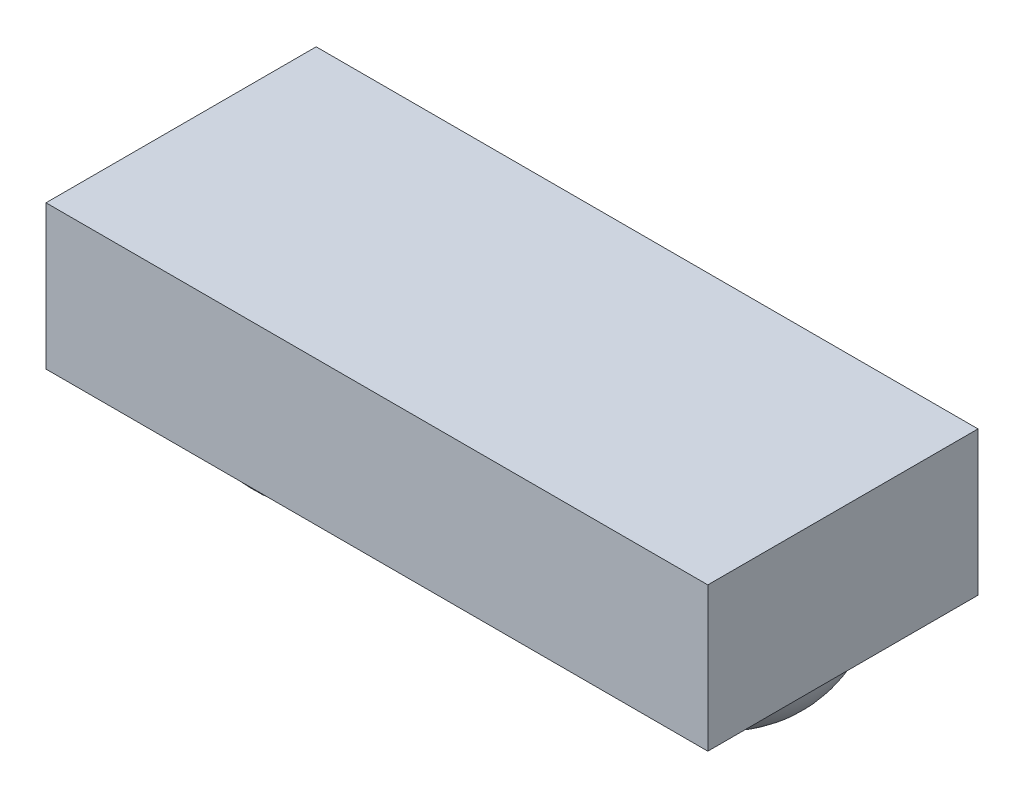
ISO-10303-21;
HEADER;
FILE_DESCRIPTION(('STEP AP214'),'2;1');
FILE_NAME('part.step','',(''),(''),'','','');
FILE_SCHEMA(('AUTOMOTIVE_DESIGN { 1 0 10303 214 1 1 1 1 }'));
ENDSEC;
DATA;
#1=APPLICATION_CONTEXT('core data for automotive mechanical design processes');
#2=APPLICATION_PROTOCOL_DEFINITION('international standard','automotive_design',2000,#1);
#3=PRODUCT_CONTEXT('',#1,'mechanical');
#4=PRODUCT('Part','Part','',(#3));
#5=PRODUCT_RELATED_PRODUCT_CATEGORY('part','',(#4));
#6=PRODUCT_DEFINITION_FORMATION('','',#4);
#7=PRODUCT_DEFINITION_CONTEXT('part definition',#1,'design');
#8=PRODUCT_DEFINITION('design','',#6,#7);
#9=PRODUCT_DEFINITION_SHAPE('','',#8);
#10=(LENGTH_UNIT() NAMED_UNIT(*) SI_UNIT(.MILLI.,.METRE.));
#11=(NAMED_UNIT(*) PLANE_ANGLE_UNIT() SI_UNIT($,.RADIAN.));
#12=(NAMED_UNIT(*) SI_UNIT($,.STERADIAN.) SOLID_ANGLE_UNIT());
#13=UNCERTAINTY_MEASURE_WITH_UNIT(LENGTH_MEASURE(1.E-05),#10,'distance_accuracy_value','');
#14=(GEOMETRIC_REPRESENTATION_CONTEXT(3) GLOBAL_UNCERTAINTY_ASSIGNED_CONTEXT((#13)) GLOBAL_UNIT_ASSIGNED_CONTEXT((#10,
#11,#12)) REPRESENTATION_CONTEXT('',''));
#15=CARTESIAN_POINT('',(0.,0.,0.));
#16=DIRECTION('',(0.,0.,1.));
#17=DIRECTION('',(1.,0.,0.));
#18=AXIS2_PLACEMENT_3D('',#15,#16,#17);
#19=CARTESIAN_POINT('',(0.,3.59044061302682,4.07));
#20=DIRECTION('',(0.,-1.,0.));
#21=DIRECTION('',(0.,0.,-1.));
#22=AXIS2_PLACEMENT_3D('',#19,#20,#21);
#23=PLANE('',#22);
#24=DIRECTION('',(-1.,0.,0.));
#25=VECTOR('',#24,1.);
#26=CARTESIAN_POINT('',(0.,3.59044061302682,0.));
#27=LINE('',#26,#25);
#28=CARTESIAN_POINT('',(4.985,3.59044061302682,0.));
#29=VERTEX_POINT('',#28);
#30=CARTESIAN_POINT('',(-4.985,3.59044061302682,0.));
#31=VERTEX_POINT('',#30);
#32=EDGE_CURVE('E129',#29,#31,#27,.T.);
#33=ORIENTED_EDGE('',*,*,#32,.T.);
#34=DIRECTION('',(0.,0.,-1.));
#35=VECTOR('',#34,1.);
#36=CARTESIAN_POINT('',(-4.985,3.59044061302682,4.07));
#37=LINE('',#36,#35);
#38=CARTESIAN_POINT('',(-4.985,3.59044061302682,4.07));
#39=VERTEX_POINT('',#38);
#40=EDGE_CURVE('E160',#39,#31,#37,.T.);
#41=ORIENTED_EDGE('',*,*,#40,.F.);
#42=DIRECTION('',(-1.,0.,0.));
#43=VECTOR('',#42,1.);
#44=CARTESIAN_POINT('',(0.,3.59044061302682,4.07));
#45=LINE('',#44,#43);
#46=CARTESIAN_POINT('',(4.985,3.59044061302682,4.07));
#47=VERTEX_POINT('',#46);
#48=EDGE_CURVE('E137',#47,#39,#45,.T.);
#49=ORIENTED_EDGE('',*,*,#48,.F.);
#50=DIRECTION('',(0.,0.,-1.));
#51=VECTOR('',#50,1.);
#52=CARTESIAN_POINT('',(4.985,3.59044061302682,4.07));
#53=LINE('',#52,#51);
#54=EDGE_CURVE('E58',#47,#29,#53,.T.);
#55=ORIENTED_EDGE('',*,*,#54,.T.);
#56=EDGE_LOOP('',(#33,#41,#49,#55));
#57=FACE_BOUND('',#56,.T.);
#58=ADVANCED_FACE('F35',(#57),#23,.F.);
#59=CARTESIAN_POINT('',(-4.985,0.,4.07));
#60=DIRECTION('',(1.,0.,0.));
#61=DIRECTION('',(0.,0.,-1.));
#62=AXIS2_PLACEMENT_3D('',#59,#60,#61);
#63=PLANE('',#62);
#64=DIRECTION('',(0.,-1.,0.));
#65=VECTOR('',#64,1.);
#66=CARTESIAN_POINT('',(-4.985,0.,0.));
#67=LINE('',#66,#65);
#68=CARTESIAN_POINT('',(-4.985,1.42044061302682,0.));
#69=VERTEX_POINT('',#68);
#70=EDGE_CURVE('E131',#31,#69,#67,.T.);
#71=ORIENTED_EDGE('',*,*,#70,.T.);
#72=DIRECTION('',(0.,0.,-1.));
#73=VECTOR('',#72,1.);
#74=CARTESIAN_POINT('',(-4.985,1.42044061302682,4.07));
#75=LINE('',#74,#73);
#76=CARTESIAN_POINT('',(-4.985,1.42044061302682,4.07));
#77=VERTEX_POINT('',#76);
#78=EDGE_CURVE('E157',#77,#69,#75,.T.);
#79=ORIENTED_EDGE('',*,*,#78,.F.);
#80=DIRECTION('',(0.,-1.,0.));
#81=VECTOR('',#80,1.);
#82=CARTESIAN_POINT('',(-4.985,0.,4.07));
#83=LINE('',#82,#81);
#84=EDGE_CURVE('E85',#39,#77,#83,.T.);
#85=ORIENTED_EDGE('',*,*,#84,.F.);
#86=ORIENTED_EDGE('',*,*,#40,.T.);
#87=EDGE_LOOP('',(#71,#79,#85,#86));
#88=FACE_BOUND('',#87,.T.);
#89=ADVANCED_FACE('F170',(#88),#63,.F.);
#90=CARTESIAN_POINT('',(0.,1.42044061302682,4.07));
#91=DIRECTION('',(0.,-1.,0.));
#92=DIRECTION('',(0.,0.,-1.));
#93=AXIS2_PLACEMENT_3D('',#90,#91,#92);
#94=PLANE('',#93);
#95=CARTESIAN_POINT('',(3.105,1.42044061302682,1.9));
#96=DIRECTION('',(0.,-1.,0.));
#97=DIRECTION('',(0.,0.,-1.));
#98=AXIS2_PLACEMENT_3D('',#95,#96,#97);
#99=CIRCLE('',#98,1.58745078663875);
#100=CARTESIAN_POINT('',(3.105,1.42044061302682,0.312549213361246));
#101=VERTEX_POINT('',#100);
#102=EDGE_CURVE('E11',#101,#101,#99,.T.);
#103=ORIENTED_EDGE('',*,*,#102,.F.);
#104=EDGE_LOOP('',(#103));
#105=FACE_BOUND('',#104,.T.);
#106=CARTESIAN_POINT('',(-3.005,1.42044061302682,1.78));
#107=DIRECTION('',(0.,-1.,0.));
#108=DIRECTION('',(0.,0.,-1.));
#109=AXIS2_PLACEMENT_3D('',#106,#107,#108);
#110=CIRCLE('',#109,1.6);
#111=CARTESIAN_POINT('',(-3.005,1.42044061302682,0.18));
#112=VERTEX_POINT('',#111);
#113=EDGE_CURVE('E42',#112,#112,#110,.T.);
#114=ORIENTED_EDGE('',*,*,#113,.F.);
#115=EDGE_LOOP('',(#114));
#116=FACE_BOUND('',#115,.T.);
#117=DIRECTION('',(0.,0.,-1.));
#118=VECTOR('',#117,1.);
#119=CARTESIAN_POINT('',(-0.875,1.42044061302682,0.2));
#120=LINE('',#119,#118);
#121=CARTESIAN_POINT('',(-0.875,1.42044061302682,0.2));
#122=VERTEX_POINT('',#121);
#123=CARTESIAN_POINT('',(-0.875,1.42044061302682,0.));
#124=VERTEX_POINT('',#123);
#125=EDGE_CURVE('E133',#122,#124,#120,.T.);
#126=ORIENTED_EDGE('',*,*,#125,.F.);
#127=DIRECTION('',(-1.,0.,0.));
#128=VECTOR('',#127,1.);
#129=CARTESIAN_POINT('',(0.,1.42044061302682,0.2));
#130=LINE('',#129,#128);
#131=CARTESIAN_POINT('',(0.875,1.42044061302682,0.2));
#132=VERTEX_POINT('',#131);
#133=EDGE_CURVE('E115',#132,#122,#130,.T.);
#134=ORIENTED_EDGE('',*,*,#133,.F.);
#135=DIRECTION('',(0.,0.,-1.));
#136=VECTOR('',#135,1.);
#137=CARTESIAN_POINT('',(0.875,1.42044061302682,0.2));
#138=LINE('',#137,#136);
#139=CARTESIAN_POINT('',(0.875,1.42044061302682,0.));
#140=VERTEX_POINT('',#139);
#141=EDGE_CURVE('E112',#132,#140,#138,.T.);
#142=ORIENTED_EDGE('',*,*,#141,.T.);
#143=DIRECTION('',(-1.,0.,0.));
#144=VECTOR('',#143,1.);
#145=CARTESIAN_POINT('',(0.,1.42044061302682,0.));
#146=LINE('',#145,#144);
#147=CARTESIAN_POINT('',(4.985,1.42044061302682,0.));
#148=VERTEX_POINT('',#147);
#149=EDGE_CURVE('E149',#148,#140,#146,.T.);
#150=ORIENTED_EDGE('',*,*,#149,.F.);
#151=DIRECTION('',(0.,0.,-1.));
#152=VECTOR('',#151,1.);
#153=CARTESIAN_POINT('',(4.985,1.42044061302682,4.07));
#154=LINE('',#153,#152);
#155=CARTESIAN_POINT('',(4.985,1.42044061302682,4.07));
#156=VERTEX_POINT('',#155);
#157=EDGE_CURVE('E155',#156,#148,#154,.T.);
#158=ORIENTED_EDGE('',*,*,#157,.F.);
#159=DIRECTION('',(-1.,0.,0.));
#160=VECTOR('',#159,1.);
#161=CARTESIAN_POINT('',(0.,1.42044061302682,4.07));
#162=LINE('',#161,#160);
#163=EDGE_CURVE('E141',#156,#77,#162,.T.);
#164=ORIENTED_EDGE('',*,*,#163,.T.);
#165=ORIENTED_EDGE('',*,*,#78,.T.);
#166=EDGE_CURVE('E148',#124,#69,#146,.T.);
#167=ORIENTED_EDGE('',*,*,#166,.F.);
#168=EDGE_LOOP('',(#126,#134,#142,#150,#158,#164,#165,#167));
#169=FACE_BOUND('',#168,.T.);
#170=ADVANCED_FACE('F166',(#105,#116,#169),#94,.T.);
#171=CARTESIAN_POINT('',(4.985,0.,4.07));
#172=DIRECTION('',(1.,0.,0.));
#173=DIRECTION('',(0.,0.,-1.));
#174=AXIS2_PLACEMENT_3D('',#171,#172,#173);
#175=PLANE('',#174);
#176=DIRECTION('',(0.,-1.,0.));
#177=VECTOR('',#176,1.);
#178=CARTESIAN_POINT('',(4.985,0.,0.));
#179=LINE('',#178,#177);
#180=EDGE_CURVE('E139',#29,#148,#179,.T.);
#181=ORIENTED_EDGE('',*,*,#180,.F.);
#182=ORIENTED_EDGE('',*,*,#54,.F.);
#183=DIRECTION('',(0.,-1.,0.));
#184=VECTOR('',#183,1.);
#185=CARTESIAN_POINT('',(4.985,0.,4.07));
#186=LINE('',#185,#184);
#187=EDGE_CURVE('E144',#47,#156,#186,.T.);
#188=ORIENTED_EDGE('',*,*,#187,.T.);
#189=ORIENTED_EDGE('',*,*,#157,.T.);
#190=EDGE_LOOP('',(#181,#182,#188,#189));
#191=FACE_BOUND('',#190,.T.);
#192=ADVANCED_FACE('F169',(#191),#175,.T.);
#193=CARTESIAN_POINT('',(0.,0.,4.07));
#194=DIRECTION('',(0.,0.,1.));
#195=DIRECTION('',(1.,0.,0.));
#196=AXIS2_PLACEMENT_3D('',#193,#194,#195);
#197=PLANE('',#196);
#198=ORIENTED_EDGE('',*,*,#48,.T.);
#199=ORIENTED_EDGE('',*,*,#84,.T.);
#200=ORIENTED_EDGE('',*,*,#163,.F.);
#201=ORIENTED_EDGE('',*,*,#187,.F.);
#202=EDGE_LOOP('',(#198,#199,#200,#201));
#203=FACE_BOUND('',#202,.T.);
#204=ADVANCED_FACE('F224',(#203),#197,.T.);
#205=CARTESIAN_POINT('',(0.,0.,0.));
#206=DIRECTION('',(0.,0.,1.));
#207=DIRECTION('',(1.,0.,0.));
#208=AXIS2_PLACEMENT_3D('',#205,#206,#207);
#209=PLANE('',#208);
#210=ORIENTED_EDGE('',*,*,#32,.F.);
#211=ORIENTED_EDGE('',*,*,#180,.T.);
#212=ORIENTED_EDGE('',*,*,#149,.T.);
#213=DIRECTION('',(0.,1.,0.));
#214=VECTOR('',#213,1.);
#215=CARTESIAN_POINT('',(0.875,0.,0.));
#216=LINE('',#215,#214);
#217=CARTESIAN_POINT('',(0.875,0.790440613026821,0.));
#218=VERTEX_POINT('',#217);
#219=EDGE_CURVE('E49',#218,#140,#216,.T.);
#220=ORIENTED_EDGE('',*,*,#219,.F.);
#221=DIRECTION('',(1.,0.,0.));
#222=VECTOR('',#221,1.);
#223=CARTESIAN_POINT('',(0.,0.790440613026821,0.));
#224=LINE('',#223,#222);
#225=CARTESIAN_POINT('',(-0.875,0.790440613026821,0.));
#226=VERTEX_POINT('',#225);
#227=EDGE_CURVE('E128',#226,#218,#224,.T.);
#228=ORIENTED_EDGE('',*,*,#227,.F.);
#229=DIRECTION('',(0.,1.,0.));
#230=VECTOR('',#229,1.);
#231=CARTESIAN_POINT('',(-0.875,0.,0.));
#232=LINE('',#231,#230);
#233=EDGE_CURVE('E124',#226,#124,#232,.T.);
#234=ORIENTED_EDGE('',*,*,#233,.T.);
#235=ORIENTED_EDGE('',*,*,#166,.T.);
#236=ORIENTED_EDGE('',*,*,#70,.F.);
#237=EDGE_LOOP('',(#210,#211,#212,#220,#228,#234,#235,#236));
#238=FACE_BOUND('',#237,.T.);
#239=ADVANCED_FACE('F208',(#238),#209,.F.);
#240=CARTESIAN_POINT('',(0.,0.790440613026821,0.2));
#241=DIRECTION('',(0.,1.,0.));
#242=DIRECTION('',(-1.,0.,0.));
#243=AXIS2_PLACEMENT_3D('',#240,#241,#242);
#244=PLANE('',#243);
#245=ORIENTED_EDGE('',*,*,#227,.T.);
#246=DIRECTION('',(0.,0.,-1.));
#247=VECTOR('',#246,1.);
#248=CARTESIAN_POINT('',(0.875,0.790440613026821,0.2));
#249=LINE('',#248,#247);
#250=CARTESIAN_POINT('',(0.875,0.790440613026821,0.2));
#251=VERTEX_POINT('',#250);
#252=EDGE_CURVE('E110',#251,#218,#249,.T.);
#253=ORIENTED_EDGE('',*,*,#252,.F.);
#254=DIRECTION('',(1.,0.,0.));
#255=VECTOR('',#254,1.);
#256=CARTESIAN_POINT('',(0.,0.790440613026821,0.2));
#257=LINE('',#256,#255);
#258=CARTESIAN_POINT('',(-0.875,0.790440613026821,0.2));
#259=VERTEX_POINT('',#258);
#260=EDGE_CURVE('E116',#259,#251,#257,.T.);
#261=ORIENTED_EDGE('',*,*,#260,.F.);
#262=DIRECTION('',(0.,0.,-1.));
#263=VECTOR('',#262,1.);
#264=CARTESIAN_POINT('',(-0.875,0.790440613026821,0.2));
#265=LINE('',#264,#263);
#266=EDGE_CURVE('E178',#259,#226,#265,.T.);
#267=ORIENTED_EDGE('',*,*,#266,.T.);
#268=EDGE_LOOP('',(#245,#253,#261,#267));
#269=FACE_BOUND('',#268,.T.);
#270=ADVANCED_FACE('F126',(#269),#244,.F.);
#271=CARTESIAN_POINT('',(0.875,0.,0.2));
#272=DIRECTION('',(-1.,0.,0.));
#273=DIRECTION('',(0.,0.,1.));
#274=AXIS2_PLACEMENT_3D('',#271,#272,#273);
#275=PLANE('',#274);
#276=ORIENTED_EDGE('',*,*,#219,.T.);
#277=ORIENTED_EDGE('',*,*,#141,.F.);
#278=DIRECTION('',(0.,1.,0.));
#279=VECTOR('',#278,1.);
#280=CARTESIAN_POINT('',(0.875,0.,0.2));
#281=LINE('',#280,#279);
#282=EDGE_CURVE('E106',#251,#132,#281,.T.);
#283=ORIENTED_EDGE('',*,*,#282,.F.);
#284=ORIENTED_EDGE('',*,*,#252,.T.);
#285=EDGE_LOOP('',(#276,#277,#283,#284));
#286=FACE_BOUND('',#285,.T.);
#287=ADVANCED_FACE('F108',(#286),#275,.F.);
#288=CARTESIAN_POINT('',(-0.875,0.,0.2));
#289=DIRECTION('',(-1.,0.,0.));
#290=DIRECTION('',(0.,0.,1.));
#291=AXIS2_PLACEMENT_3D('',#288,#289,#290);
#292=PLANE('',#291);
#293=ORIENTED_EDGE('',*,*,#233,.F.);
#294=ORIENTED_EDGE('',*,*,#266,.F.);
#295=DIRECTION('',(0.,1.,0.));
#296=VECTOR('',#295,1.);
#297=CARTESIAN_POINT('',(-0.875,0.,0.2));
#298=LINE('',#297,#296);
#299=EDGE_CURVE('E122',#259,#122,#298,.T.);
#300=ORIENTED_EDGE('',*,*,#299,.T.);
#301=ORIENTED_EDGE('',*,*,#125,.T.);
#302=EDGE_LOOP('',(#293,#294,#300,#301));
#303=FACE_BOUND('',#302,.T.);
#304=ADVANCED_FACE('F212',(#303),#292,.T.);
#305=CARTESIAN_POINT('',(0.,0.,0.2));
#306=DIRECTION('',(0.,0.,1.));
#307=DIRECTION('',(1.,0.,0.));
#308=AXIS2_PLACEMENT_3D('',#305,#306,#307);
#309=PLANE('',#308);
#310=ORIENTED_EDGE('',*,*,#260,.T.);
#311=ORIENTED_EDGE('',*,*,#282,.T.);
#312=ORIENTED_EDGE('',*,*,#133,.T.);
#313=ORIENTED_EDGE('',*,*,#299,.F.);
#314=EDGE_LOOP('',(#310,#311,#312,#313));
#315=FACE_BOUND('',#314,.T.);
#316=ADVANCED_FACE('F120',(#315),#309,.T.);
#317=CARTESIAN_POINT('',(-3.005,1.42044061302682,1.78));
#318=DIRECTION('',(0.,1.,0.));
#319=DIRECTION('',(-1.,0.,0.));
#320=AXIS2_PLACEMENT_3D('',#317,#318,#319);
#321=CYLINDRICAL_SURFACE('',#320,1.6);
#322=CARTESIAN_POINT('',(-3.005,1.38044061302682,1.78));
#323=DIRECTION('',(0.,1.,0.));
#324=DIRECTION('',(-1.,0.,0.));
#325=AXIS2_PLACEMENT_3D('',#322,#323,#324);
#326=CIRCLE('',#325,1.6);
#327=CARTESIAN_POINT('',(-4.605,1.38044061302682,1.78));
#328=VERTEX_POINT('',#327);
#329=EDGE_CURVE('E184',#328,#328,#326,.T.);
#330=ORIENTED_EDGE('',*,*,#329,.T.);
#331=EDGE_LOOP('',(#330));
#332=FACE_BOUND('',#331,.T.);
#333=ORIENTED_EDGE('',*,*,#113,.T.);
#334=EDGE_LOOP('',(#333));
#335=FACE_BOUND('',#334,.T.);
#336=ADVANCED_FACE('F164',(#332,#335),#321,.T.);
#337=CARTESIAN_POINT('',(-3.005,1.38044061302682,1.78));
#338=DIRECTION('',(0.,1.,0.));
#339=DIRECTION('',(-1.,0.,0.));
#340=AXIS2_PLACEMENT_3D('',#337,#338,#339);
#341=SPHERICAL_SURFACE('',#340,1.6);
#342=ORIENTED_EDGE('',*,*,#329,.F.);
#343=EDGE_LOOP('',(#342));
#344=FACE_BOUND('',#343,.T.);
#345=ADVANCED_FACE('F191',(#344),#341,.T.);
#346=CARTESIAN_POINT('',(3.105,1.62044061302682,1.9));
#347=DIRECTION('',(0.,1.,0.));
#348=DIRECTION('',(-1.,0.,0.));
#349=AXIS2_PLACEMENT_3D('',#346,#347,#348);
#350=SPHERICAL_SURFACE('',#349,1.6);
#351=ORIENTED_EDGE('',*,*,#102,.T.);
#352=EDGE_LOOP('',(#351));
#353=FACE_BOUND('',#352,.T.);
#354=ADVANCED_FACE('F193',(#353),#350,.T.);
#355=CLOSED_SHELL('',(#58,#89,#170,#192,#204,#239,#270,#287,#304,#316,#336,#345,#354));
#356=MANIFOLD_SOLID_BREP('B2',#355);
#357=ADVANCED_BREP_SHAPE_REPRESENTATION('',(#18,#356),#14);
#358=SHAPE_DEFINITION_REPRESENTATION(#9,#357);
ENDSEC;
END-ISO-10303-21;
